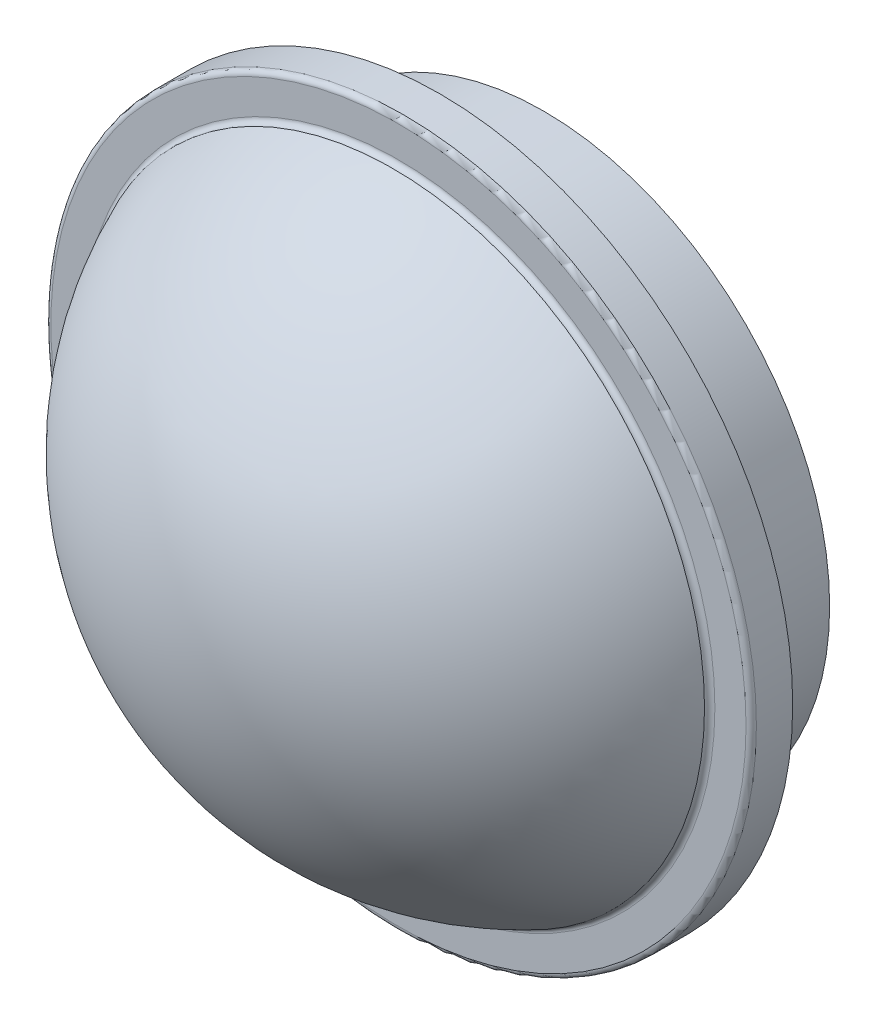
ISO-10303-21;
HEADER;
FILE_DESCRIPTION(('STEP AP214'),'2;1');
FILE_NAME('part.step','',(''),(''),'','','');
FILE_SCHEMA(('AUTOMOTIVE_DESIGN { 1 0 10303 214 1 1 1 1 }'));
ENDSEC;
DATA;
#1=APPLICATION_CONTEXT('core data for automotive mechanical design processes');
#2=APPLICATION_PROTOCOL_DEFINITION('international standard','automotive_design',2000,#1);
#3=PRODUCT_CONTEXT('',#1,'mechanical');
#4=PRODUCT('Part','Part','',(#3));
#5=PRODUCT_RELATED_PRODUCT_CATEGORY('part','',(#4));
#6=PRODUCT_DEFINITION_FORMATION('','',#4);
#7=PRODUCT_DEFINITION_CONTEXT('part definition',#1,'design');
#8=PRODUCT_DEFINITION('design','',#6,#7);
#9=PRODUCT_DEFINITION_SHAPE('','',#8);
#10=(LENGTH_UNIT() NAMED_UNIT(*) SI_UNIT(.MILLI.,.METRE.));
#11=(NAMED_UNIT(*) PLANE_ANGLE_UNIT() SI_UNIT($,.RADIAN.));
#12=(NAMED_UNIT(*) SI_UNIT($,.STERADIAN.) SOLID_ANGLE_UNIT());
#13=UNCERTAINTY_MEASURE_WITH_UNIT(LENGTH_MEASURE(1.E-05),#10,'distance_accuracy_value','');
#14=(GEOMETRIC_REPRESENTATION_CONTEXT(3) GLOBAL_UNCERTAINTY_ASSIGNED_CONTEXT((#13)) GLOBAL_UNIT_ASSIGNED_CONTEXT((#10,
#11,#12)) REPRESENTATION_CONTEXT('',''));
#15=CARTESIAN_POINT('',(0.,0.,0.));
#16=DIRECTION('',(0.,0.,1.));
#17=DIRECTION('',(1.,0.,0.));
#18=AXIS2_PLACEMENT_3D('',#15,#16,#17);
#19=CARTESIAN_POINT('',(0.,0.,2.));
#20=DIRECTION('',(0.,0.,-1.));
#21=DIRECTION('',(-1.,0.,0.));
#22=AXIS2_PLACEMENT_3D('',#19,#20,#21);
#23=CYLINDRICAL_SURFACE('',#22,17.);
#24=CARTESIAN_POINT('',(0.,0.,1.75));
#25=DIRECTION('',(0.,0.,1.));
#26=DIRECTION('',(1.,0.,0.));
#27=AXIS2_PLACEMENT_3D('',#24,#25,#26);
#28=CIRCLE('',#27,17.);
#29=CARTESIAN_POINT('',(17.,0.,1.75));
#30=VERTEX_POINT('',#29);
#31=EDGE_CURVE('E10',#30,#30,#28,.F.);
#32=ORIENTED_EDGE('',*,*,#31,.T.);
#33=EDGE_LOOP('',(#32));
#34=FACE_BOUND('',#33,.T.);
#35=CARTESIAN_POINT('',(0.,0.,0.));
#36=DIRECTION('',(0.,0.,1.));
#37=DIRECTION('',(1.,0.,0.));
#38=AXIS2_PLACEMENT_3D('',#35,#36,#37);
#39=CIRCLE('',#38,17.);
#40=CARTESIAN_POINT('',(17.,0.,0.));
#41=VERTEX_POINT('',#40);
#42=EDGE_CURVE('E58',#41,#41,#39,.T.);
#43=ORIENTED_EDGE('',*,*,#42,.T.);
#44=EDGE_LOOP('',(#43));
#45=FACE_BOUND('',#44,.T.);
#46=ADVANCED_FACE('F31',(#34,#45),#23,.T.);
#47=CARTESIAN_POINT('',(0.,0.,2.));
#48=DIRECTION('',(0.,0.,1.));
#49=DIRECTION('',(1.,0.,0.));
#50=AXIS2_PLACEMENT_3D('',#47,#48,#49);
#51=PLANE('',#50);
#52=CARTESIAN_POINT('',(0.,0.,2.));
#53=DIRECTION('',(0.,0.,1.));
#54=DIRECTION('',(1.,0.,0.));
#55=AXIS2_PLACEMENT_3D('',#52,#53,#54);
#56=CIRCLE('',#55,15.25);
#57=CARTESIAN_POINT('',(15.25,0.,2.));
#58=VERTEX_POINT('',#57);
#59=EDGE_CURVE('E38',#58,#58,#56,.F.);
#60=ORIENTED_EDGE('',*,*,#59,.T.);
#61=EDGE_LOOP('',(#60));
#62=FACE_BOUND('',#61,.T.);
#63=CARTESIAN_POINT('',(0.,0.,2.));
#64=DIRECTION('',(0.,0.,1.));
#65=DIRECTION('',(1.,0.,0.));
#66=AXIS2_PLACEMENT_3D('',#63,#64,#65);
#67=CIRCLE('',#66,16.75);
#68=CARTESIAN_POINT('',(16.75,0.,2.));
#69=VERTEX_POINT('',#68);
#70=EDGE_CURVE('E42',#69,#69,#67,.T.);
#71=ORIENTED_EDGE('',*,*,#70,.T.);
#72=EDGE_LOOP('',(#71));
#73=FACE_BOUND('',#72,.T.);
#74=ADVANCED_FACE('F82',(#62,#73),#51,.T.);
#75=CARTESIAN_POINT('',(0.,0.,0.));
#76=DIRECTION('',(0.,0.,1.));
#77=DIRECTION('',(1.,0.,0.));
#78=AXIS2_PLACEMENT_3D('',#75,#76,#77);
#79=PLANE('',#78);
#80=CARTESIAN_POINT('',(0.,0.,0.));
#81=DIRECTION('',(0.,0.,1.));
#82=DIRECTION('',(1.,0.,0.));
#83=AXIS2_PLACEMENT_3D('',#80,#81,#82);
#84=CIRCLE('',#83,13.78);
#85=CARTESIAN_POINT('',(13.78,0.,0.));
#86=VERTEX_POINT('',#85);
#87=EDGE_CURVE('E46',#86,#86,#84,.F.);
#88=ORIENTED_EDGE('',*,*,#87,.F.);
#89=EDGE_LOOP('',(#88));
#90=FACE_BOUND('',#89,.T.);
#91=ORIENTED_EDGE('',*,*,#42,.F.);
#92=EDGE_LOOP('',(#91));
#93=FACE_BOUND('',#92,.T.);
#94=ADVANCED_FACE('F73',(#90,#93),#79,.F.);
#95=CARTESIAN_POINT('',(0.,0.,-5.));
#96=DIRECTION('',(0.,0.,-1.));
#97=DIRECTION('',(-1.,0.,0.));
#98=AXIS2_PLACEMENT_3D('',#95,#96,#97);
#99=PLANE('',#98);
#100=CARTESIAN_POINT('',(0.,0.,-5.));
#101=DIRECTION('',(0.,0.,-1.));
#102=DIRECTION('',(-1.,0.,0.));
#103=AXIS2_PLACEMENT_3D('',#100,#101,#102);
#104=CIRCLE('',#103,13.78);
#105=CARTESIAN_POINT('',(-13.78,0.,-5.));
#106=VERTEX_POINT('',#105);
#107=EDGE_CURVE('E61',#106,#106,#104,.T.);
#108=ORIENTED_EDGE('',*,*,#107,.T.);
#109=EDGE_LOOP('',(#108));
#110=FACE_BOUND('',#109,.T.);
#111=CARTESIAN_POINT('',(0.,0.,-5.));
#112=DIRECTION('',(0.,0.,-1.));
#113=DIRECTION('',(-1.,0.,0.));
#114=AXIS2_PLACEMENT_3D('',#111,#112,#113);
#115=CIRCLE('',#114,11.);
#116=CARTESIAN_POINT('',(-11.,0.,-5.));
#117=VERTEX_POINT('',#116);
#118=EDGE_CURVE('E52',#117,#117,#115,.T.);
#119=ORIENTED_EDGE('',*,*,#118,.F.);
#120=EDGE_LOOP('',(#119));
#121=FACE_BOUND('',#120,.T.);
#122=ADVANCED_FACE('F70',(#110,#121),#99,.T.);
#123=CARTESIAN_POINT('',(0.,0.,-5.));
#124=DIRECTION('',(0.,0.,1.));
#125=DIRECTION('',(1.,0.,0.));
#126=AXIS2_PLACEMENT_3D('',#123,#124,#125);
#127=CYLINDRICAL_SURFACE('',#126,13.78);
#128=ORIENTED_EDGE('',*,*,#107,.F.);
#129=EDGE_LOOP('',(#128));
#130=FACE_BOUND('',#129,.T.);
#131=ORIENTED_EDGE('',*,*,#87,.T.);
#132=EDGE_LOOP('',(#131));
#133=FACE_BOUND('',#132,.T.);
#134=ADVANCED_FACE('F72',(#130,#133),#127,.T.);
#135=CARTESIAN_POINT('',(0.,0.,-5.));
#136=DIRECTION('',(0.,0.,1.));
#137=DIRECTION('',(1.,0.,0.));
#138=AXIS2_PLACEMENT_3D('',#135,#136,#137);
#139=CYLINDRICAL_SURFACE('',#138,11.);
#140=ORIENTED_EDGE('',*,*,#118,.T.);
#141=EDGE_LOOP('',(#140));
#142=FACE_BOUND('',#141,.T.);
#143=CARTESIAN_POINT('',(0.,0.,0.));
#144=DIRECTION('',(0.,0.,-1.));
#145=DIRECTION('',(-1.,0.,0.));
#146=AXIS2_PLACEMENT_3D('',#143,#144,#145);
#147=CIRCLE('',#146,11.);
#148=CARTESIAN_POINT('',(-11.,0.,0.));
#149=VERTEX_POINT('',#148);
#150=EDGE_CURVE('E49',#149,#149,#147,.T.);
#151=ORIENTED_EDGE('',*,*,#150,.F.);
#152=EDGE_LOOP('',(#151));
#153=FACE_BOUND('',#152,.T.);
#154=ADVANCED_FACE('F67',(#142,#153),#139,.F.);
#155=CARTESIAN_POINT('',(0.,0.,0.));
#156=DIRECTION('',(0.,0.,1.));
#157=DIRECTION('',(1.,0.,0.));
#158=AXIS2_PLACEMENT_3D('',#155,#156,#157);
#159=SPHERICAL_SURFACE('',#158,11.);
#160=ORIENTED_EDGE('',*,*,#150,.T.);
#161=EDGE_LOOP('',(#160));
#162=FACE_BOUND('',#161,.T.);
#163=ADVANCED_FACE('F98',(#162),#159,.F.);
#164=CARTESIAN_POINT('',(0.,0.,-4.));
#165=DIRECTION('',(0.,0.,1.));
#166=DIRECTION('',(1.,0.,0.));
#167=AXIS2_PLACEMENT_3D('',#164,#165,#166);
#168=SPHERICAL_SURFACE('',#167,16.25);
#169=CARTESIAN_POINT('',(0.,0.,2.25));
#170=DIRECTION('',(0.,0.,1.));
#171=DIRECTION('',(1.,0.,0.));
#172=AXIS2_PLACEMENT_3D('',#169,#170,#171);
#173=CIRCLE('',#172,15.);
#174=CARTESIAN_POINT('',(15.,0.,2.25));
#175=VERTEX_POINT('',#174);
#176=EDGE_CURVE('E53',#175,#175,#173,.T.);
#177=ORIENTED_EDGE('',*,*,#176,.T.);
#178=EDGE_LOOP('',(#177));
#179=FACE_BOUND('',#178,.T.);
#180=ADVANCED_FACE('F94',(#179),#168,.T.);
#181=CARTESIAN_POINT('',(0.,0.,2.25));
#182=DIRECTION('',(0.,0.,1.));
#183=DIRECTION('',(1.,0.,0.));
#184=AXIS2_PLACEMENT_3D('',#181,#182,#183);
#185=TOROIDAL_SURFACE('',#184,15.25,0.25);
#186=ORIENTED_EDGE('',*,*,#59,.F.);
#187=EDGE_LOOP('',(#186));
#188=FACE_BOUND('',#187,.T.);
#189=ORIENTED_EDGE('',*,*,#176,.F.);
#190=EDGE_LOOP('',(#189));
#191=FACE_BOUND('',#190,.T.);
#192=ADVANCED_FACE('F97',(#188,#191),#185,.F.);
#193=CARTESIAN_POINT('',(0.,0.,1.75));
#194=DIRECTION('',(0.,0.,1.));
#195=DIRECTION('',(1.,0.,0.));
#196=AXIS2_PLACEMENT_3D('',#193,#194,#195);
#197=TOROIDAL_SURFACE('',#196,16.75,0.25);
#198=ORIENTED_EDGE('',*,*,#31,.F.);
#199=EDGE_LOOP('',(#198));
#200=FACE_BOUND('',#199,.T.);
#201=ORIENTED_EDGE('',*,*,#70,.F.);
#202=EDGE_LOOP('',(#201));
#203=FACE_BOUND('',#202,.T.);
#204=ADVANCED_FACE('F33',(#200,#203),#197,.T.);
#205=CLOSED_SHELL('',(#46,#74,#94,#122,#134,#154,#163,#180,#192,#204));
#206=MANIFOLD_SOLID_BREP('B2',#205);
#207=ADVANCED_BREP_SHAPE_REPRESENTATION('',(#18,#206),#14);
#208=SHAPE_DEFINITION_REPRESENTATION(#9,#207);
ENDSEC;
END-ISO-10303-21;
